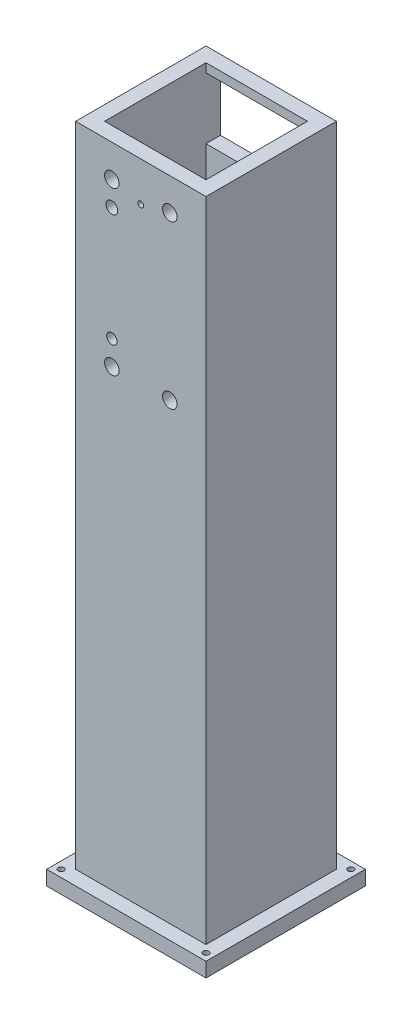
ISO-10303-21;
HEADER;
FILE_DESCRIPTION(('STEP AP214'),'2;1');
FILE_NAME('part.step','',(''),(''),'','','');
FILE_SCHEMA(('AUTOMOTIVE_DESIGN { 1 0 10303 214 1 1 1 1 }'));
ENDSEC;
DATA;
#1=APPLICATION_CONTEXT('core data for automotive mechanical design processes');
#2=APPLICATION_PROTOCOL_DEFINITION('international standard','automotive_design',2000,#1);
#3=PRODUCT_CONTEXT('',#1,'mechanical');
#4=PRODUCT('Part','Part','',(#3));
#5=PRODUCT_RELATED_PRODUCT_CATEGORY('part','',(#4));
#6=PRODUCT_DEFINITION_FORMATION('','',#4);
#7=PRODUCT_DEFINITION_CONTEXT('part definition',#1,'design');
#8=PRODUCT_DEFINITION('design','',#6,#7);
#9=PRODUCT_DEFINITION_SHAPE('','',#8);
#10=(LENGTH_UNIT() NAMED_UNIT(*) SI_UNIT(.MILLI.,.METRE.));
#11=(NAMED_UNIT(*) PLANE_ANGLE_UNIT() SI_UNIT($,.RADIAN.));
#12=(NAMED_UNIT(*) SI_UNIT($,.STERADIAN.) SOLID_ANGLE_UNIT());
#13=UNCERTAINTY_MEASURE_WITH_UNIT(LENGTH_MEASURE(1.E-05),#10,'distance_accuracy_value','');
#14=(GEOMETRIC_REPRESENTATION_CONTEXT(3) GLOBAL_UNCERTAINTY_ASSIGNED_CONTEXT((#13)) GLOBAL_UNIT_ASSIGNED_CONTEXT((#10,
#11,#12)) REPRESENTATION_CONTEXT('',''));
#15=CARTESIAN_POINT('',(0.,0.,0.));
#16=DIRECTION('',(0.,0.,1.));
#17=DIRECTION('',(1.,0.,0.));
#18=AXIS2_PLACEMENT_3D('',#15,#16,#17);
#19=CARTESIAN_POINT('',(-17.5,0.,-17.5));
#20=DIRECTION('',(0.,0.,1.));
#21=DIRECTION('',(1.,0.,0.));
#22=AXIS2_PLACEMENT_3D('',#19,#20,#21);
#23=PLANE('',#22);
#24=DIRECTION('',(1.,0.,0.));
#25=VECTOR('',#24,1.);
#26=CARTESIAN_POINT('',(-17.5,273.612120728358,-17.5));
#27=LINE('',#26,#25);
#28=CARTESIAN_POINT('',(-17.5,273.612120728358,-17.5));
#29=VERTEX_POINT('',#28);
#30=CARTESIAN_POINT('',(17.5,273.612120728358,-17.5));
#31=VERTEX_POINT('',#30);
#32=EDGE_CURVE('E264',#29,#31,#27,.T.);
#33=ORIENTED_EDGE('',*,*,#32,.F.);
#34=DIRECTION('',(0.,1.,0.));
#35=VECTOR('',#34,1.);
#36=CARTESIAN_POINT('',(-17.5,0.,-17.5));
#37=LINE('',#36,#35);
#38=CARTESIAN_POINT('',(-17.5,270.587205010945,-17.5));
#39=VERTEX_POINT('',#38);
#40=EDGE_CURVE('E309',#39,#29,#37,.T.);
#41=ORIENTED_EDGE('',*,*,#40,.F.);
#42=DIRECTION('',(1.,0.,0.));
#43=VECTOR('',#42,1.);
#44=CARTESIAN_POINT('',(-17.5,270.587205010945,-17.5));
#45=LINE('',#44,#43);
#46=CARTESIAN_POINT('',(17.5,270.587205010945,-17.5));
#47=VERTEX_POINT('',#46);
#48=EDGE_CURVE('E328',#39,#47,#45,.T.);
#49=ORIENTED_EDGE('',*,*,#48,.T.);
#50=DIRECTION('',(0.,1.,0.));
#51=VECTOR('',#50,1.);
#52=CARTESIAN_POINT('',(17.5,0.,-17.5));
#53=LINE('',#52,#51);
#54=EDGE_CURVE('E305',#47,#31,#53,.T.);
#55=ORIENTED_EDGE('',*,*,#54,.T.);
#56=EDGE_LOOP('',(#33,#41,#49,#55));
#57=FACE_BOUND('',#56,.T.);
#58=ADVANCED_FACE('F47',(#57),#23,.T.);
#59=CARTESIAN_POINT('',(22.5,300.,22.5));
#60=DIRECTION('',(-1.,0.,0.));
#61=DIRECTION('',(0.,0.,1.));
#62=AXIS2_PLACEMENT_3D('',#59,#60,#61);
#63=PLANE('',#62);
#64=DIRECTION('',(0.,-1.,0.));
#65=VECTOR('',#64,1.);
#66=CARTESIAN_POINT('',(22.5,300.,22.5));
#67=LINE('',#66,#65);
#68=CARTESIAN_POINT('',(22.5,273.612120728358,22.5));
#69=VERTEX_POINT('',#68);
#70=CARTESIAN_POINT('',(22.5,50.,22.5));
#71=VERTEX_POINT('',#70);
#72=EDGE_CURVE('E313',#69,#71,#67,.T.);
#73=ORIENTED_EDGE('',*,*,#72,.T.);
#74=DIRECTION('',(0.,0.,1.));
#75=VECTOR('',#74,1.);
#76=CARTESIAN_POINT('',(22.5,50.,22.5));
#77=LINE('',#76,#75);
#78=CARTESIAN_POINT('',(22.5,50.,-22.5));
#79=VERTEX_POINT('',#78);
#80=EDGE_CURVE('E214',#79,#71,#77,.T.);
#81=ORIENTED_EDGE('',*,*,#80,.F.);
#82=DIRECTION('',(0.,-1.,0.));
#83=VECTOR('',#82,1.);
#84=CARTESIAN_POINT('',(22.5,300.,-22.5));
#85=LINE('',#84,#83);
#86=CARTESIAN_POINT('',(22.5,273.612120728358,-22.5));
#87=VERTEX_POINT('',#86);
#88=EDGE_CURVE('E324',#87,#79,#85,.T.);
#89=ORIENTED_EDGE('',*,*,#88,.F.);
#90=DIRECTION('',(0.,0.,1.));
#91=VECTOR('',#90,1.);
#92=CARTESIAN_POINT('',(22.5,273.612120728358,-22.5));
#93=LINE('',#92,#91);
#94=EDGE_CURVE('E252',#87,#69,#93,.T.);
#95=ORIENTED_EDGE('',*,*,#94,.T.);
#96=EDGE_LOOP('',(#73,#81,#89,#95));
#97=FACE_BOUND('',#96,.T.);
#98=ADVANCED_FACE('F49',(#97),#63,.F.);
#99=CARTESIAN_POINT('',(-22.5,300.,-22.5));
#100=DIRECTION('',(0.,0.,1.));
#101=DIRECTION('',(1.,0.,0.));
#102=AXIS2_PLACEMENT_3D('',#99,#100,#101);
#103=PLANE('',#102);
#104=CARTESIAN_POINT('',(-10.,206.502607410294,-22.5));
#105=DIRECTION('',(0.,0.,1.));
#106=DIRECTION('',(1.,0.,0.));
#107=AXIS2_PLACEMENT_3D('',#104,#105,#106);
#108=CIRCLE('',#107,2.5);
#109=CARTESIAN_POINT('',(-7.5,206.502607410294,-22.5));
#110=VERTEX_POINT('',#109);
#111=EDGE_CURVE('E363',#110,#110,#108,.T.);
#112=ORIENTED_EDGE('',*,*,#111,.T.);
#113=EDGE_LOOP('',(#112));
#114=FACE_BOUND('',#113,.T.);
#115=CARTESIAN_POINT('',(-10.,214.902607410294,-22.5));
#116=DIRECTION('',(0.,0.,1.));
#117=DIRECTION('',(1.,0.,0.));
#118=AXIS2_PLACEMENT_3D('',#115,#116,#117);
#119=CIRCLE('',#118,1.79330821876043);
#120=CARTESIAN_POINT('',(-8.20669178123957,214.902607410294,-22.5));
#121=VERTEX_POINT('',#120);
#122=EDGE_CURVE('E358',#121,#121,#119,.T.);
#123=ORIENTED_EDGE('',*,*,#122,.T.);
#124=EDGE_LOOP('',(#123));
#125=FACE_BOUND('',#124,.T.);
#126=CARTESIAN_POINT('',(10.,206.502607410294,-22.5));
#127=DIRECTION('',(0.,0.,1.));
#128=DIRECTION('',(1.,0.,0.));
#129=AXIS2_PLACEMENT_3D('',#126,#127,#128);
#130=CIRCLE('',#129,2.5);
#131=CARTESIAN_POINT('',(12.5,206.502607410294,-22.5));
#132=VERTEX_POINT('',#131);
#133=EDGE_CURVE('E352',#132,#132,#130,.T.);
#134=ORIENTED_EDGE('',*,*,#133,.T.);
#135=EDGE_LOOP('',(#134));
#136=FACE_BOUND('',#135,.T.);
#137=DIRECTION('',(0.,1.,0.));
#138=VECTOR('',#137,1.);
#139=CARTESIAN_POINT('',(-17.5,249.412794989055,-22.5));
#140=LINE('',#139,#138);
#141=CARTESIAN_POINT('',(-17.5,249.412794989055,-22.5));
#142=VERTEX_POINT('',#141);
#143=CARTESIAN_POINT('',(-17.5,270.587205010945,-22.5));
#144=VERTEX_POINT('',#143);
#145=EDGE_CURVE('E275',#142,#144,#140,.T.);
#146=ORIENTED_EDGE('',*,*,#145,.F.);
#147=DIRECTION('',(-1.,0.,0.));
#148=VECTOR('',#147,1.);
#149=CARTESIAN_POINT('',(17.5,249.412794989055,-22.5));
#150=LINE('',#149,#148);
#151=CARTESIAN_POINT('',(17.5,249.412794989055,-22.5));
#152=VERTEX_POINT('',#151);
#153=EDGE_CURVE('E272',#152,#142,#150,.T.);
#154=ORIENTED_EDGE('',*,*,#153,.F.);
#155=DIRECTION('',(0.,1.,0.));
#156=VECTOR('',#155,1.);
#157=CARTESIAN_POINT('',(17.5,249.412794989055,-22.5));
#158=LINE('',#157,#156);
#159=CARTESIAN_POINT('',(17.5,270.587205010945,-22.5));
#160=VERTEX_POINT('',#159);
#161=EDGE_CURVE('E283',#152,#160,#158,.T.);
#162=ORIENTED_EDGE('',*,*,#161,.T.);
#163=DIRECTION('',(-1.,0.,0.));
#164=VECTOR('',#163,1.);
#165=CARTESIAN_POINT('',(17.5,270.587205010945,-22.5));
#166=LINE('',#165,#164);
#167=EDGE_CURVE('E279',#160,#144,#166,.T.);
#168=ORIENTED_EDGE('',*,*,#167,.T.);
#169=EDGE_LOOP('',(#146,#154,#162,#168));
#170=FACE_BOUND('',#169,.T.);
#171=ORIENTED_EDGE('',*,*,#88,.T.);
#172=DIRECTION('',(1.,0.,0.));
#173=VECTOR('',#172,1.);
#174=CARTESIAN_POINT('',(-22.5,50.,-22.5));
#175=LINE('',#174,#173);
#176=CARTESIAN_POINT('',(-22.5,50.,-22.5));
#177=VERTEX_POINT('',#176);
#178=EDGE_CURVE('E227',#177,#79,#175,.T.);
#179=ORIENTED_EDGE('',*,*,#178,.F.);
#180=DIRECTION('',(0.,-1.,0.));
#181=VECTOR('',#180,1.);
#182=CARTESIAN_POINT('',(-22.5,300.,-22.5));
#183=LINE('',#182,#181);
#184=CARTESIAN_POINT('',(-22.5,273.612120728358,-22.5));
#185=VERTEX_POINT('',#184);
#186=EDGE_CURVE('E320',#185,#177,#183,.T.);
#187=ORIENTED_EDGE('',*,*,#186,.F.);
#188=DIRECTION('',(1.,0.,0.));
#189=VECTOR('',#188,1.);
#190=CARTESIAN_POINT('',(-22.5,273.612120728358,-22.5));
#191=LINE('',#190,#189);
#192=EDGE_CURVE('E246',#185,#87,#191,.T.);
#193=ORIENTED_EDGE('',*,*,#192,.T.);
#194=EDGE_LOOP('',(#171,#179,#187,#193));
#195=FACE_BOUND('',#194,.T.);
#196=ADVANCED_FACE('F442',(#114,#125,#136,#170,#195),#103,.F.);
#197=CARTESIAN_POINT('',(-22.5,300.,22.5));
#198=DIRECTION('',(1.,0.,0.));
#199=DIRECTION('',(0.,0.,-1.));
#200=AXIS2_PLACEMENT_3D('',#197,#198,#199);
#201=PLANE('',#200);
#202=ORIENTED_EDGE('',*,*,#186,.T.);
#203=DIRECTION('',(0.,0.,1.));
#204=VECTOR('',#203,1.);
#205=CARTESIAN_POINT('',(-22.5,50.,22.5));
#206=LINE('',#205,#204);
#207=CARTESIAN_POINT('',(-22.5,50.,22.5));
#208=VERTEX_POINT('',#207);
#209=EDGE_CURVE('E224',#177,#208,#206,.T.);
#210=ORIENTED_EDGE('',*,*,#209,.T.);
#211=DIRECTION('',(0.,-1.,0.));
#212=VECTOR('',#211,1.);
#213=CARTESIAN_POINT('',(-22.5,300.,22.5));
#214=LINE('',#213,#212);
#215=CARTESIAN_POINT('',(-22.5,273.612120728358,22.5));
#216=VERTEX_POINT('',#215);
#217=EDGE_CURVE('E316',#216,#208,#214,.T.);
#218=ORIENTED_EDGE('',*,*,#217,.F.);
#219=DIRECTION('',(0.,0.,1.));
#220=VECTOR('',#219,1.);
#221=CARTESIAN_POINT('',(-22.5,273.612120728358,-22.5));
#222=LINE('',#221,#220);
#223=EDGE_CURVE('E65',#185,#216,#222,.T.);
#224=ORIENTED_EDGE('',*,*,#223,.F.);
#225=EDGE_LOOP('',(#202,#210,#218,#224));
#226=FACE_BOUND('',#225,.T.);
#227=ADVANCED_FACE('F439',(#226),#201,.F.);
#228=CARTESIAN_POINT('',(-22.5,300.,22.5));
#229=DIRECTION('',(0.,0.,-1.));
#230=DIRECTION('',(-1.,0.,0.));
#231=AXIS2_PLACEMENT_3D('',#228,#229,#230);
#232=PLANE('',#231);
#233=CARTESIAN_POINT('',(10.,262.502607410294,22.5));
#234=DIRECTION('',(0.,0.,-1.));
#235=DIRECTION('',(-1.,0.,0.));
#236=AXIS2_PLACEMENT_3D('',#233,#234,#235);
#237=CIRCLE('',#236,2.5);
#238=CARTESIAN_POINT('',(7.5,262.502607410294,22.5));
#239=VERTEX_POINT('',#238);
#240=EDGE_CURVE('E381',#239,#239,#237,.T.);
#241=ORIENTED_EDGE('',*,*,#240,.T.);
#242=EDGE_LOOP('',(#241));
#243=FACE_BOUND('',#242,.T.);
#244=CARTESIAN_POINT('',(-10.,206.502607410294,22.5));
#245=DIRECTION('',(0.,0.,-1.));
#246=DIRECTION('',(-1.,0.,0.));
#247=AXIS2_PLACEMENT_3D('',#244,#245,#246);
#248=CIRCLE('',#247,2.5);
#249=CARTESIAN_POINT('',(-12.5,206.502607410294,22.5));
#250=VERTEX_POINT('',#249);
#251=EDGE_CURVE('E565',#250,#250,#248,.T.);
#252=ORIENTED_EDGE('',*,*,#251,.T.);
#253=EDGE_LOOP('',(#252));
#254=FACE_BOUND('',#253,.T.);
#255=CARTESIAN_POINT('',(-10.,214.902607410294,22.5));
#256=DIRECTION('',(0.,0.,-1.));
#257=DIRECTION('',(-1.,0.,0.));
#258=AXIS2_PLACEMENT_3D('',#255,#256,#257);
#259=CIRCLE('',#258,1.79330821876043);
#260=CARTESIAN_POINT('',(-11.7933082187604,214.902607410294,22.5));
#261=VERTEX_POINT('',#260);
#262=EDGE_CURVE('E557',#261,#261,#259,.T.);
#263=ORIENTED_EDGE('',*,*,#262,.T.);
#264=EDGE_LOOP('',(#263));
#265=FACE_BOUND('',#264,.T.);
#266=CARTESIAN_POINT('',(-10.,254.102607410294,22.5));
#267=DIRECTION('',(0.,0.,-1.));
#268=DIRECTION('',(-1.,0.,0.));
#269=AXIS2_PLACEMENT_3D('',#266,#267,#268);
#270=CIRCLE('',#269,2.02999999999999);
#271=CARTESIAN_POINT('',(-12.03,254.102607410294,22.5));
#272=VERTEX_POINT('',#271);
#273=EDGE_CURVE('E367',#272,#272,#270,.T.);
#274=ORIENTED_EDGE('',*,*,#273,.T.);
#275=EDGE_LOOP('',(#274));
#276=FACE_BOUND('',#275,.T.);
#277=CARTESIAN_POINT('',(10.,206.502607410294,22.5));
#278=DIRECTION('',(0.,0.,-1.));
#279=DIRECTION('',(-1.,0.,0.));
#280=AXIS2_PLACEMENT_3D('',#277,#278,#279);
#281=CIRCLE('',#280,2.5);
#282=CARTESIAN_POINT('',(7.5,206.502607410294,22.5));
#283=VERTEX_POINT('',#282);
#284=EDGE_CURVE('E547',#283,#283,#281,.T.);
#285=ORIENTED_EDGE('',*,*,#284,.T.);
#286=EDGE_LOOP('',(#285));
#287=FACE_BOUND('',#286,.T.);
#288=CARTESIAN_POINT('',(-10.,262.502607410294,22.5));
#289=DIRECTION('',(0.,0.,-1.));
#290=DIRECTION('',(-1.,0.,0.));
#291=AXIS2_PLACEMENT_3D('',#288,#289,#290);
#292=CIRCLE('',#291,2.5);
#293=CARTESIAN_POINT('',(-12.5,262.502607410294,22.5));
#294=VERTEX_POINT('',#293);
#295=EDGE_CURVE('E362',#294,#294,#292,.T.);
#296=ORIENTED_EDGE('',*,*,#295,.T.);
#297=EDGE_LOOP('',(#296));
#298=FACE_BOUND('',#297,.T.);
#299=CARTESIAN_POINT('',(0.,260.,22.5));
#300=DIRECTION('',(0.,0.,1.));
#301=DIRECTION('',(1.,0.,0.));
#302=AXIS2_PLACEMENT_3D('',#299,#300,#301);
#303=CIRCLE('',#302,1.);
#304=CARTESIAN_POINT('',(1.,260.,22.5));
#305=VERTEX_POINT('',#304);
#306=EDGE_CURVE('E267',#305,#305,#303,.T.);
#307=ORIENTED_EDGE('',*,*,#306,.F.);
#308=EDGE_LOOP('',(#307));
#309=FACE_BOUND('',#308,.T.);
#310=ORIENTED_EDGE('',*,*,#217,.T.);
#311=DIRECTION('',(1.,0.,0.));
#312=VECTOR('',#311,1.);
#313=CARTESIAN_POINT('',(-22.5,50.,22.5));
#314=LINE('',#313,#312);
#315=EDGE_CURVE('E228',#208,#71,#314,.T.);
#316=ORIENTED_EDGE('',*,*,#315,.T.);
#317=ORIENTED_EDGE('',*,*,#72,.F.);
#318=DIRECTION('',(1.,0.,0.));
#319=VECTOR('',#318,1.);
#320=CARTESIAN_POINT('',(-22.5,273.612120728358,22.5));
#321=LINE('',#320,#319);
#322=EDGE_CURVE('E245',#216,#69,#321,.T.);
#323=ORIENTED_EDGE('',*,*,#322,.F.);
#324=EDGE_LOOP('',(#310,#316,#317,#323));
#325=FACE_BOUND('',#324,.T.);
#326=ADVANCED_FACE('F436',(#243,#254,#265,#276,#287,#298,#309,#325),#232,.F.);
#327=CARTESIAN_POINT('',(-17.5,0.,17.5));
#328=DIRECTION('',(1.,0.,0.));
#329=DIRECTION('',(0.,0.,-1.));
#330=AXIS2_PLACEMENT_3D('',#327,#328,#329);
#331=PLANE('',#330);
#332=DIRECTION('',(0.,0.,1.));
#333=VECTOR('',#332,1.);
#334=CARTESIAN_POINT('',(-17.5,50.,17.5));
#335=LINE('',#334,#333);
#336=CARTESIAN_POINT('',(-17.5,50.,-17.5));
#337=VERTEX_POINT('',#336);
#338=CARTESIAN_POINT('',(-17.5,50.,17.5));
#339=VERTEX_POINT('',#338);
#340=EDGE_CURVE('E238',#337,#339,#335,.T.);
#341=ORIENTED_EDGE('',*,*,#340,.F.);
#342=CARTESIAN_POINT('',(-17.5,249.412794989055,-17.5));
#343=VERTEX_POINT('',#342);
#344=EDGE_CURVE('E310',#337,#343,#37,.T.);
#345=ORIENTED_EDGE('',*,*,#344,.T.);
#346=DIRECTION('',(0.,0.,-1.));
#347=VECTOR('',#346,1.);
#348=CARTESIAN_POINT('',(-17.5,249.412794989055,-12.5));
#349=LINE('',#348,#347);
#350=EDGE_CURVE('E287',#343,#142,#349,.T.);
#351=ORIENTED_EDGE('',*,*,#350,.T.);
#352=ORIENTED_EDGE('',*,*,#145,.T.);
#353=DIRECTION('',(0.,0.,-1.));
#354=VECTOR('',#353,1.);
#355=CARTESIAN_POINT('',(-17.5,270.587205010945,-12.5));
#356=LINE('',#355,#354);
#357=EDGE_CURVE('E295',#39,#144,#356,.T.);
#358=ORIENTED_EDGE('',*,*,#357,.F.);
#359=ORIENTED_EDGE('',*,*,#40,.T.);
#360=DIRECTION('',(0.,0.,-1.));
#361=VECTOR('',#360,1.);
#362=CARTESIAN_POINT('',(-17.5,273.612120728358,17.5));
#363=LINE('',#362,#361);
#364=CARTESIAN_POINT('',(-17.5,273.612120728358,17.5));
#365=VERTEX_POINT('',#364);
#366=EDGE_CURVE('E261',#365,#29,#363,.T.);
#367=ORIENTED_EDGE('',*,*,#366,.F.);
#368=DIRECTION('',(0.,1.,0.));
#369=VECTOR('',#368,1.);
#370=CARTESIAN_POINT('',(-17.5,0.,17.5));
#371=LINE('',#370,#369);
#372=EDGE_CURVE('E291',#339,#365,#371,.T.);
#373=ORIENTED_EDGE('',*,*,#372,.F.);
#374=EDGE_LOOP('',(#341,#345,#351,#352,#358,#359,#367,#373));
#375=FACE_BOUND('',#374,.T.);
#376=ADVANCED_FACE('F501',(#375),#331,.T.);
#377=CARTESIAN_POINT('',(17.5,0.,17.5));
#378=DIRECTION('',(1.,0.,0.));
#379=DIRECTION('',(0.,0.,-1.));
#380=AXIS2_PLACEMENT_3D('',#377,#378,#379);
#381=PLANE('',#380);
#382=CARTESIAN_POINT('',(17.5,50.,-17.5));
#383=VERTEX_POINT('',#382);
#384=CARTESIAN_POINT('',(17.5,249.412794989055,-17.5));
#385=VERTEX_POINT('',#384);
#386=EDGE_CURVE('E306',#383,#385,#53,.T.);
#387=ORIENTED_EDGE('',*,*,#386,.F.);
#388=DIRECTION('',(0.,0.,1.));
#389=VECTOR('',#388,1.);
#390=CARTESIAN_POINT('',(17.5,50.,17.5));
#391=LINE('',#390,#389);
#392=CARTESIAN_POINT('',(17.5,50.,17.5));
#393=VERTEX_POINT('',#392);
#394=EDGE_CURVE('E232',#383,#393,#391,.T.);
#395=ORIENTED_EDGE('',*,*,#394,.T.);
#396=DIRECTION('',(0.,1.,0.));
#397=VECTOR('',#396,1.);
#398=CARTESIAN_POINT('',(17.5,0.,17.5));
#399=LINE('',#398,#397);
#400=CARTESIAN_POINT('',(17.5,273.612120728358,17.5));
#401=VERTEX_POINT('',#400);
#402=EDGE_CURVE('E73',#393,#401,#399,.T.);
#403=ORIENTED_EDGE('',*,*,#402,.T.);
#404=DIRECTION('',(0.,0.,-1.));
#405=VECTOR('',#404,1.);
#406=CARTESIAN_POINT('',(17.5,273.612120728358,17.5));
#407=LINE('',#406,#405);
#408=EDGE_CURVE('E256',#401,#31,#407,.T.);
#409=ORIENTED_EDGE('',*,*,#408,.T.);
#410=ORIENTED_EDGE('',*,*,#54,.F.);
#411=DIRECTION('',(0.,0.,-1.));
#412=VECTOR('',#411,1.);
#413=CARTESIAN_POINT('',(17.5,270.587205010945,-12.5));
#414=LINE('',#413,#412);
#415=EDGE_CURVE('E292',#47,#160,#414,.T.);
#416=ORIENTED_EDGE('',*,*,#415,.T.);
#417=ORIENTED_EDGE('',*,*,#161,.F.);
#418=DIRECTION('',(0.,0.,-1.));
#419=VECTOR('',#418,1.);
#420=CARTESIAN_POINT('',(17.5,249.412794989055,-12.5));
#421=LINE('',#420,#419);
#422=EDGE_CURVE('E288',#385,#152,#421,.T.);
#423=ORIENTED_EDGE('',*,*,#422,.F.);
#424=EDGE_LOOP('',(#387,#395,#403,#409,#410,#416,#417,#423));
#425=FACE_BOUND('',#424,.T.);
#426=ADVANCED_FACE('F481',(#425),#381,.F.);
#427=CARTESIAN_POINT('',(-17.5,0.,17.5));
#428=DIRECTION('',(0.,0.,1.));
#429=DIRECTION('',(1.,0.,0.));
#430=AXIS2_PLACEMENT_3D('',#427,#428,#429);
#431=PLANE('',#430);
#432=CARTESIAN_POINT('',(10.,262.502607410294,17.5));
#433=DIRECTION('',(0.,0.,1.));
#434=DIRECTION('',(1.,0.,0.));
#435=AXIS2_PLACEMENT_3D('',#432,#433,#434);
#436=CIRCLE('',#435,2.5);
#437=CARTESIAN_POINT('',(12.5,262.502607410294,17.5));
#438=VERTEX_POINT('',#437);
#439=EDGE_CURVE('E51',#438,#438,#436,.T.);
#440=ORIENTED_EDGE('',*,*,#439,.T.);
#441=EDGE_LOOP('',(#440));
#442=FACE_BOUND('',#441,.T.);
#443=CARTESIAN_POINT('',(-10.,206.502607410294,17.5));
#444=DIRECTION('',(0.,0.,1.));
#445=DIRECTION('',(1.,0.,0.));
#446=AXIS2_PLACEMENT_3D('',#443,#444,#445);
#447=CIRCLE('',#446,2.5);
#448=CARTESIAN_POINT('',(-7.5,206.502607410294,17.5));
#449=VERTEX_POINT('',#448);
#450=EDGE_CURVE('E357',#449,#449,#447,.T.);
#451=ORIENTED_EDGE('',*,*,#450,.T.);
#452=EDGE_LOOP('',(#451));
#453=FACE_BOUND('',#452,.T.);
#454=CARTESIAN_POINT('',(-10.,214.902607410294,17.5));
#455=DIRECTION('',(0.,0.,1.));
#456=DIRECTION('',(1.,0.,0.));
#457=AXIS2_PLACEMENT_3D('',#454,#455,#456);
#458=CIRCLE('',#457,1.79330821876043);
#459=CARTESIAN_POINT('',(-8.20669178123957,214.902607410294,17.5));
#460=VERTEX_POINT('',#459);
#461=EDGE_CURVE('E351',#460,#460,#458,.T.);
#462=ORIENTED_EDGE('',*,*,#461,.T.);
#463=EDGE_LOOP('',(#462));
#464=FACE_BOUND('',#463,.T.);
#465=CARTESIAN_POINT('',(-10.,254.102607410294,17.5));
#466=DIRECTION('',(0.,0.,1.));
#467=DIRECTION('',(1.,0.,0.));
#468=AXIS2_PLACEMENT_3D('',#465,#466,#467);
#469=CIRCLE('',#468,2.02999999999999);
#470=CARTESIAN_POINT('',(-7.97000000000001,254.102607410294,17.5));
#471=VERTEX_POINT('',#470);
#472=EDGE_CURVE('E364',#471,#471,#469,.T.);
#473=ORIENTED_EDGE('',*,*,#472,.T.);
#474=EDGE_LOOP('',(#473));
#475=FACE_BOUND('',#474,.T.);
#476=CARTESIAN_POINT('',(10.,206.502607410294,17.5));
#477=DIRECTION('',(0.,0.,1.));
#478=DIRECTION('',(1.,0.,0.));
#479=AXIS2_PLACEMENT_3D('',#476,#477,#478);
#480=CIRCLE('',#479,2.5);
#481=CARTESIAN_POINT('',(12.5,206.502607410294,17.5));
#482=VERTEX_POINT('',#481);
#483=EDGE_CURVE('E346',#482,#482,#480,.T.);
#484=ORIENTED_EDGE('',*,*,#483,.T.);
#485=EDGE_LOOP('',(#484));
#486=FACE_BOUND('',#485,.T.);
#487=CARTESIAN_POINT('',(-10.,262.502607410294,17.5));
#488=DIRECTION('',(0.,0.,1.));
#489=DIRECTION('',(1.,0.,0.));
#490=AXIS2_PLACEMENT_3D('',#487,#488,#489);
#491=CIRCLE('',#490,2.5);
#492=CARTESIAN_POINT('',(-7.5,262.502607410294,17.5));
#493=VERTEX_POINT('',#492);
#494=EDGE_CURVE('E359',#493,#493,#491,.T.);
#495=ORIENTED_EDGE('',*,*,#494,.T.);
#496=EDGE_LOOP('',(#495));
#497=FACE_BOUND('',#496,.T.);
#498=CARTESIAN_POINT('',(0.,260.,17.5));
#499=DIRECTION('',(0.,0.,1.));
#500=DIRECTION('',(1.,0.,0.));
#501=AXIS2_PLACEMENT_3D('',#498,#499,#500);
#502=CIRCLE('',#501,1.);
#503=CARTESIAN_POINT('',(1.,260.,17.5));
#504=VERTEX_POINT('',#503);
#505=EDGE_CURVE('E271',#504,#504,#502,.T.);
#506=ORIENTED_EDGE('',*,*,#505,.T.);
#507=EDGE_LOOP('',(#506));
#508=FACE_BOUND('',#507,.T.);
#509=ORIENTED_EDGE('',*,*,#402,.F.);
#510=DIRECTION('',(-1.,0.,0.));
#511=VECTOR('',#510,1.);
#512=CARTESIAN_POINT('',(-17.5,50.,17.5));
#513=LINE('',#512,#511);
#514=EDGE_CURVE('E241',#393,#339,#513,.T.);
#515=ORIENTED_EDGE('',*,*,#514,.T.);
#516=ORIENTED_EDGE('',*,*,#372,.T.);
#517=DIRECTION('',(1.,0.,0.));
#518=VECTOR('',#517,1.);
#519=CARTESIAN_POINT('',(-17.5,273.612120728358,17.5));
#520=LINE('',#519,#518);
#521=EDGE_CURVE('E57',#365,#401,#520,.T.);
#522=ORIENTED_EDGE('',*,*,#521,.T.);
#523=EDGE_LOOP('',(#509,#515,#516,#522));
#524=FACE_BOUND('',#523,.T.);
#525=ADVANCED_FACE('F472',(#442,#453,#464,#475,#486,#497,#508,#524),#431,.F.);
#526=CARTESIAN_POINT('',(-10.,206.502607410294,-17.5));
#527=DIRECTION('',(0.,0.,1.));
#528=DIRECTION('',(1.,0.,0.));
#529=AXIS2_PLACEMENT_3D('',#526,#527,#528);
#530=CIRCLE('',#529,2.5);
#531=CARTESIAN_POINT('',(-7.5,206.502607410294,-17.5));
#532=VERTEX_POINT('',#531);
#533=EDGE_CURVE('E353',#532,#532,#530,.T.);
#534=ORIENTED_EDGE('',*,*,#533,.F.);
#535=EDGE_LOOP('',(#534));
#536=FACE_BOUND('',#535,.T.);
#537=CARTESIAN_POINT('',(-10.,214.902607410294,-17.5));
#538=DIRECTION('',(0.,0.,1.));
#539=DIRECTION('',(1.,0.,0.));
#540=AXIS2_PLACEMENT_3D('',#537,#538,#539);
#541=CIRCLE('',#540,1.79330821876043);
#542=CARTESIAN_POINT('',(-8.20669178123957,214.902607410294,-17.5));
#543=VERTEX_POINT('',#542);
#544=EDGE_CURVE('E347',#543,#543,#541,.T.);
#545=ORIENTED_EDGE('',*,*,#544,.F.);
#546=EDGE_LOOP('',(#545));
#547=FACE_BOUND('',#546,.T.);
#548=CARTESIAN_POINT('',(10.,206.502607410294,-17.5));
#549=DIRECTION('',(0.,0.,1.));
#550=DIRECTION('',(1.,0.,0.));
#551=AXIS2_PLACEMENT_3D('',#548,#549,#550);
#552=CIRCLE('',#551,2.5);
#553=CARTESIAN_POINT('',(12.5,206.502607410294,-17.5));
#554=VERTEX_POINT('',#553);
#555=EDGE_CURVE('E342',#554,#554,#552,.T.);
#556=ORIENTED_EDGE('',*,*,#555,.F.);
#557=EDGE_LOOP('',(#556));
#558=FACE_BOUND('',#557,.T.);
#559=DIRECTION('',(-1.,0.,0.));
#560=VECTOR('',#559,1.);
#561=CARTESIAN_POINT('',(-17.5,50.,-17.5));
#562=LINE('',#561,#560);
#563=EDGE_CURVE('E11',#383,#337,#562,.T.);
#564=ORIENTED_EDGE('',*,*,#563,.F.);
#565=ORIENTED_EDGE('',*,*,#386,.T.);
#566=DIRECTION('',(1.,0.,0.));
#567=VECTOR('',#566,1.);
#568=CARTESIAN_POINT('',(-17.5,249.412794989055,-17.5));
#569=LINE('',#568,#567);
#570=EDGE_CURVE('E332',#343,#385,#569,.T.);
#571=ORIENTED_EDGE('',*,*,#570,.F.);
#572=ORIENTED_EDGE('',*,*,#344,.F.);
#573=EDGE_LOOP('',(#564,#565,#571,#572));
#574=FACE_BOUND('',#573,.T.);
#575=ADVANCED_FACE('F462',(#536,#547,#558,#574),#23,.T.);
#576=CARTESIAN_POINT('',(17.5,249.412794989055,-12.5));
#577=DIRECTION('',(0.,-1.,0.));
#578=DIRECTION('',(0.,0.,-1.));
#579=AXIS2_PLACEMENT_3D('',#576,#577,#578);
#580=PLANE('',#579);
#581=ORIENTED_EDGE('',*,*,#570,.T.);
#582=ORIENTED_EDGE('',*,*,#422,.T.);
#583=ORIENTED_EDGE('',*,*,#153,.T.);
#584=ORIENTED_EDGE('',*,*,#350,.F.);
#585=EDGE_LOOP('',(#581,#582,#583,#584));
#586=FACE_BOUND('',#585,.T.);
#587=ADVANCED_FACE('F471',(#586),#580,.F.);
#588=CARTESIAN_POINT('',(17.5,270.587205010945,-12.5));
#589=DIRECTION('',(0.,-1.,0.));
#590=DIRECTION('',(0.,0.,-1.));
#591=AXIS2_PLACEMENT_3D('',#588,#589,#590);
#592=PLANE('',#591);
#593=ORIENTED_EDGE('',*,*,#357,.T.);
#594=ORIENTED_EDGE('',*,*,#167,.F.);
#595=ORIENTED_EDGE('',*,*,#415,.F.);
#596=ORIENTED_EDGE('',*,*,#48,.F.);
#597=EDGE_LOOP('',(#593,#594,#595,#596));
#598=FACE_BOUND('',#597,.T.);
#599=ADVANCED_FACE('F455',(#598),#592,.T.);
#600=CARTESIAN_POINT('',(0.,260.,12.5));
#601=DIRECTION('',(0.,0.,1.));
#602=DIRECTION('',(1.,0.,0.));
#603=AXIS2_PLACEMENT_3D('',#600,#601,#602);
#604=CYLINDRICAL_SURFACE('',#603,1.);
#605=ORIENTED_EDGE('',*,*,#306,.T.);
#606=EDGE_LOOP('',(#605));
#607=FACE_BOUND('',#606,.T.);
#608=ORIENTED_EDGE('',*,*,#505,.F.);
#609=EDGE_LOOP('',(#608));
#610=FACE_BOUND('',#609,.T.);
#611=ADVANCED_FACE('F447',(#607,#610),#604,.F.);
#612=CARTESIAN_POINT('',(-22.5,273.612120728358,-22.5));
#613=DIRECTION('',(0.,-1.,0.));
#614=DIRECTION('',(0.,0.,-1.));
#615=AXIS2_PLACEMENT_3D('',#612,#613,#614);
#616=PLANE('',#615);
#617=ORIENTED_EDGE('',*,*,#32,.T.);
#618=ORIENTED_EDGE('',*,*,#408,.F.);
#619=ORIENTED_EDGE('',*,*,#521,.F.);
#620=ORIENTED_EDGE('',*,*,#366,.T.);
#621=EDGE_LOOP('',(#617,#618,#619,#620));
#622=FACE_BOUND('',#621,.T.);
#623=ORIENTED_EDGE('',*,*,#322,.T.);
#624=ORIENTED_EDGE('',*,*,#94,.F.);
#625=ORIENTED_EDGE('',*,*,#192,.F.);
#626=ORIENTED_EDGE('',*,*,#223,.T.);
#627=EDGE_LOOP('',(#623,#624,#625,#626));
#628=FACE_BOUND('',#627,.T.);
#629=ADVANCED_FACE('F445',(#622,#628),#616,.F.);
#630=CARTESIAN_POINT('',(0.,50.,0.));
#631=DIRECTION('',(0.,1.,0.));
#632=DIRECTION('',(0.,0.,1.));
#633=AXIS2_PLACEMENT_3D('',#630,#631,#632);
#634=PLANE('',#633);
#635=ORIENTED_EDGE('',*,*,#394,.F.);
#636=ORIENTED_EDGE('',*,*,#563,.T.);
#637=ORIENTED_EDGE('',*,*,#340,.T.);
#638=ORIENTED_EDGE('',*,*,#514,.F.);
#639=EDGE_LOOP('',(#635,#636,#637,#638));
#640=FACE_BOUND('',#639,.T.);
#641=ADVANCED_FACE('F423',(#640),#634,.T.);
#642=CARTESIAN_POINT('',(25.,50.,-25.));
#643=DIRECTION('',(0.,1.,0.));
#644=DIRECTION('',(0.,0.,1.));
#645=AXIS2_PLACEMENT_3D('',#642,#643,#644);
#646=CIRCLE('',#645,1.);
#647=CARTESIAN_POINT('',(25.,50.,-24.));
#648=VERTEX_POINT('',#647);
#649=EDGE_CURVE('E197',#648,#648,#646,.T.);
#650=ORIENTED_EDGE('',*,*,#649,.F.);
#651=EDGE_LOOP('',(#650));
#652=FACE_BOUND('',#651,.T.);
#653=CARTESIAN_POINT('',(-25.,50.,-25.));
#654=DIRECTION('',(0.,1.,0.));
#655=DIRECTION('',(0.,0.,1.));
#656=AXIS2_PLACEMENT_3D('',#653,#654,#655);
#657=CIRCLE('',#656,1.);
#658=CARTESIAN_POINT('',(-25.,50.,-24.));
#659=VERTEX_POINT('',#658);
#660=EDGE_CURVE('E408',#659,#659,#657,.T.);
#661=ORIENTED_EDGE('',*,*,#660,.F.);
#662=EDGE_LOOP('',(#661));
#663=FACE_BOUND('',#662,.T.);
#664=CARTESIAN_POINT('',(-25.,50.,25.));
#665=DIRECTION('',(0.,1.,0.));
#666=DIRECTION('',(0.,0.,1.));
#667=AXIS2_PLACEMENT_3D('',#664,#665,#666);
#668=CIRCLE('',#667,1.);
#669=CARTESIAN_POINT('',(-25.,50.,26.));
#670=VERTEX_POINT('',#669);
#671=EDGE_CURVE('E405',#670,#670,#668,.T.);
#672=ORIENTED_EDGE('',*,*,#671,.F.);
#673=EDGE_LOOP('',(#672));
#674=FACE_BOUND('',#673,.T.);
#675=CARTESIAN_POINT('',(25.,50.,25.));
#676=DIRECTION('',(0.,1.,0.));
#677=DIRECTION('',(0.,0.,1.));
#678=AXIS2_PLACEMENT_3D('',#675,#676,#677);
#679=CIRCLE('',#678,1.);
#680=CARTESIAN_POINT('',(25.,50.,26.));
#681=VERTEX_POINT('',#680);
#682=EDGE_CURVE('E401',#681,#681,#679,.T.);
#683=ORIENTED_EDGE('',*,*,#682,.F.);
#684=EDGE_LOOP('',(#683));
#685=FACE_BOUND('',#684,.T.);
#686=DIRECTION('',(0.,0.,1.));
#687=VECTOR('',#686,1.);
#688=CARTESIAN_POINT('',(-27.5,50.,-27.5));
#689=LINE('',#688,#687);
#690=CARTESIAN_POINT('',(-27.5,50.,-27.5));
#691=VERTEX_POINT('',#690);
#692=CARTESIAN_POINT('',(-27.5,50.,27.5));
#693=VERTEX_POINT('',#692);
#694=EDGE_CURVE('E204',#691,#693,#689,.T.);
#695=ORIENTED_EDGE('',*,*,#694,.T.);
#696=DIRECTION('',(1.,0.,0.));
#697=VECTOR('',#696,1.);
#698=CARTESIAN_POINT('',(-27.5,50.,27.5));
#699=LINE('',#698,#697);
#700=CARTESIAN_POINT('',(27.5,50.,27.5));
#701=VERTEX_POINT('',#700);
#702=EDGE_CURVE('E169',#693,#701,#699,.T.);
#703=ORIENTED_EDGE('',*,*,#702,.T.);
#704=DIRECTION('',(0.,0.,1.));
#705=VECTOR('',#704,1.);
#706=CARTESIAN_POINT('',(27.5,50.,-27.5));
#707=LINE('',#706,#705);
#708=CARTESIAN_POINT('',(27.5,50.,-27.5));
#709=VERTEX_POINT('',#708);
#710=EDGE_CURVE('E194',#709,#701,#707,.T.);
#711=ORIENTED_EDGE('',*,*,#710,.F.);
#712=DIRECTION('',(1.,0.,0.));
#713=VECTOR('',#712,1.);
#714=CARTESIAN_POINT('',(-27.5,50.,-27.5));
#715=LINE('',#714,#713);
#716=EDGE_CURVE('E191',#691,#709,#715,.T.);
#717=ORIENTED_EDGE('',*,*,#716,.F.);
#718=EDGE_LOOP('',(#695,#703,#711,#717));
#719=FACE_BOUND('',#718,.T.);
#720=ORIENTED_EDGE('',*,*,#315,.F.);
#721=ORIENTED_EDGE('',*,*,#209,.F.);
#722=ORIENTED_EDGE('',*,*,#178,.T.);
#723=ORIENTED_EDGE('',*,*,#80,.T.);
#724=EDGE_LOOP('',(#720,#721,#722,#723));
#725=FACE_BOUND('',#724,.T.);
#726=ADVANCED_FACE('F420',(#652,#663,#674,#685,#719,#725),#634,.T.);
#727=CARTESIAN_POINT('',(-27.5,45.,-27.5));
#728=DIRECTION('',(-1.,0.,0.));
#729=DIRECTION('',(0.,0.,1.));
#730=AXIS2_PLACEMENT_3D('',#727,#728,#729);
#731=PLANE('',#730);
#732=ORIENTED_EDGE('',*,*,#694,.F.);
#733=DIRECTION('',(0.,1.,0.));
#734=VECTOR('',#733,1.);
#735=CARTESIAN_POINT('',(-27.5,45.,-27.5));
#736=LINE('',#735,#734);
#737=CARTESIAN_POINT('',(-27.5,45.,-27.5));
#738=VERTEX_POINT('',#737);
#739=EDGE_CURVE('E188',#738,#691,#736,.T.);
#740=ORIENTED_EDGE('',*,*,#739,.F.);
#741=DIRECTION('',(0.,0.,1.));
#742=VECTOR('',#741,1.);
#743=CARTESIAN_POINT('',(-27.5,45.,-27.5));
#744=LINE('',#743,#742);
#745=CARTESIAN_POINT('',(-27.5,45.,27.5));
#746=VERTEX_POINT('',#745);
#747=EDGE_CURVE('E181',#738,#746,#744,.T.);
#748=ORIENTED_EDGE('',*,*,#747,.T.);
#749=DIRECTION('',(0.,1.,0.));
#750=VECTOR('',#749,1.);
#751=CARTESIAN_POINT('',(-27.5,45.,27.5));
#752=LINE('',#751,#750);
#753=EDGE_CURVE('E164',#746,#693,#752,.T.);
#754=ORIENTED_EDGE('',*,*,#753,.T.);
#755=EDGE_LOOP('',(#732,#740,#748,#754));
#756=FACE_BOUND('',#755,.T.);
#757=ADVANCED_FACE('F187',(#756),#731,.T.);
#758=CARTESIAN_POINT('',(-27.5,45.,-27.5));
#759=DIRECTION('',(0.,0.,1.));
#760=DIRECTION('',(1.,0.,0.));
#761=AXIS2_PLACEMENT_3D('',#758,#759,#760);
#762=PLANE('',#761);
#763=ORIENTED_EDGE('',*,*,#716,.T.);
#764=DIRECTION('',(0.,1.,0.));
#765=VECTOR('',#764,1.);
#766=CARTESIAN_POINT('',(27.5,45.,-27.5));
#767=LINE('',#766,#765);
#768=CARTESIAN_POINT('',(27.5,45.,-27.5));
#769=VERTEX_POINT('',#768);
#770=EDGE_CURVE('E215',#769,#709,#767,.T.);
#771=ORIENTED_EDGE('',*,*,#770,.F.);
#772=DIRECTION('',(1.,0.,0.));
#773=VECTOR('',#772,1.);
#774=CARTESIAN_POINT('',(-27.5,45.,-27.5));
#775=LINE('',#774,#773);
#776=EDGE_CURVE('E176',#738,#769,#775,.T.);
#777=ORIENTED_EDGE('',*,*,#776,.F.);
#778=ORIENTED_EDGE('',*,*,#739,.T.);
#779=EDGE_LOOP('',(#763,#771,#777,#778));
#780=FACE_BOUND('',#779,.T.);
#781=ADVANCED_FACE('F628',(#780),#762,.F.);
#782=CARTESIAN_POINT('',(27.5,45.,-27.5));
#783=DIRECTION('',(-1.,0.,0.));
#784=DIRECTION('',(0.,0.,1.));
#785=AXIS2_PLACEMENT_3D('',#782,#783,#784);
#786=PLANE('',#785);
#787=ORIENTED_EDGE('',*,*,#710,.T.);
#788=DIRECTION('',(0.,1.,0.));
#789=VECTOR('',#788,1.);
#790=CARTESIAN_POINT('',(27.5,45.,27.5));
#791=LINE('',#790,#789);
#792=CARTESIAN_POINT('',(27.5,45.,27.5));
#793=VERTEX_POINT('',#792);
#794=EDGE_CURVE('E175',#793,#701,#791,.T.);
#795=ORIENTED_EDGE('',*,*,#794,.F.);
#796=DIRECTION('',(0.,0.,1.));
#797=VECTOR('',#796,1.);
#798=CARTESIAN_POINT('',(27.5,45.,-27.5));
#799=LINE('',#798,#797);
#800=EDGE_CURVE('E183',#769,#793,#799,.T.);
#801=ORIENTED_EDGE('',*,*,#800,.F.);
#802=ORIENTED_EDGE('',*,*,#770,.T.);
#803=EDGE_LOOP('',(#787,#795,#801,#802));
#804=FACE_BOUND('',#803,.T.);
#805=ADVANCED_FACE('F631',(#804),#786,.F.);
#806=CARTESIAN_POINT('',(-27.5,45.,27.5));
#807=DIRECTION('',(0.,0.,1.));
#808=DIRECTION('',(1.,0.,0.));
#809=AXIS2_PLACEMENT_3D('',#806,#807,#808);
#810=PLANE('',#809);
#811=ORIENTED_EDGE('',*,*,#702,.F.);
#812=ORIENTED_EDGE('',*,*,#753,.F.);
#813=DIRECTION('',(1.,0.,0.));
#814=VECTOR('',#813,1.);
#815=CARTESIAN_POINT('',(-27.5,45.,27.5));
#816=LINE('',#815,#814);
#817=EDGE_CURVE('E167',#746,#793,#816,.T.);
#818=ORIENTED_EDGE('',*,*,#817,.T.);
#819=ORIENTED_EDGE('',*,*,#794,.T.);
#820=EDGE_LOOP('',(#811,#812,#818,#819));
#821=FACE_BOUND('',#820,.T.);
#822=ADVANCED_FACE('F166',(#821),#810,.T.);
#823=CARTESIAN_POINT('',(0.,45.,0.));
#824=DIRECTION('',(0.,1.,0.));
#825=DIRECTION('',(0.,0.,1.));
#826=AXIS2_PLACEMENT_3D('',#823,#824,#825);
#827=PLANE('',#826);
#828=CARTESIAN_POINT('',(25.,45.,-25.));
#829=DIRECTION('',(0.,-1.,0.));
#830=DIRECTION('',(0.,0.,-1.));
#831=AXIS2_PLACEMENT_3D('',#828,#829,#830);
#832=CIRCLE('',#831,1.);
#833=CARTESIAN_POINT('',(25.,45.,-26.));
#834=VERTEX_POINT('',#833);
#835=EDGE_CURVE('E385',#834,#834,#832,.T.);
#836=ORIENTED_EDGE('',*,*,#835,.F.);
#837=EDGE_LOOP('',(#836));
#838=FACE_BOUND('',#837,.T.);
#839=CARTESIAN_POINT('',(-25.,45.,-25.));
#840=DIRECTION('',(0.,-1.,0.));
#841=DIRECTION('',(0.,0.,-1.));
#842=AXIS2_PLACEMENT_3D('',#839,#840,#841);
#843=CIRCLE('',#842,1.);
#844=CARTESIAN_POINT('',(-25.,45.,-26.));
#845=VERTEX_POINT('',#844);
#846=EDGE_CURVE('E391',#845,#845,#843,.T.);
#847=ORIENTED_EDGE('',*,*,#846,.F.);
#848=EDGE_LOOP('',(#847));
#849=FACE_BOUND('',#848,.T.);
#850=CARTESIAN_POINT('',(-25.,45.,25.));
#851=DIRECTION('',(0.,-1.,0.));
#852=DIRECTION('',(0.,0.,-1.));
#853=AXIS2_PLACEMENT_3D('',#850,#851,#852);
#854=CIRCLE('',#853,1.);
#855=CARTESIAN_POINT('',(-25.,45.,24.));
#856=VERTEX_POINT('',#855);
#857=EDGE_CURVE('E386',#856,#856,#854,.T.);
#858=ORIENTED_EDGE('',*,*,#857,.F.);
#859=EDGE_LOOP('',(#858));
#860=FACE_BOUND('',#859,.T.);
#861=CARTESIAN_POINT('',(25.,45.,25.));
#862=DIRECTION('',(0.,-1.,0.));
#863=DIRECTION('',(0.,0.,-1.));
#864=AXIS2_PLACEMENT_3D('',#861,#862,#863);
#865=CIRCLE('',#864,1.);
#866=CARTESIAN_POINT('',(25.,45.,24.));
#867=VERTEX_POINT('',#866);
#868=EDGE_CURVE('E390',#867,#867,#865,.T.);
#869=ORIENTED_EDGE('',*,*,#868,.F.);
#870=EDGE_LOOP('',(#869));
#871=FACE_BOUND('',#870,.T.);
#872=ORIENTED_EDGE('',*,*,#747,.F.);
#873=ORIENTED_EDGE('',*,*,#776,.T.);
#874=ORIENTED_EDGE('',*,*,#800,.T.);
#875=ORIENTED_EDGE('',*,*,#817,.F.);
#876=EDGE_LOOP('',(#872,#873,#874,#875));
#877=FACE_BOUND('',#876,.T.);
#878=ADVANCED_FACE('F180',(#838,#849,#860,#871,#877),#827,.F.);
#879=CARTESIAN_POINT('',(25.,273.612120728358,25.));
#880=DIRECTION('',(0.,-1.,0.));
#881=DIRECTION('',(0.,0.,-1.));
#882=AXIS2_PLACEMENT_3D('',#879,#880,#881);
#883=CYLINDRICAL_SURFACE('',#882,1.);
#884=ORIENTED_EDGE('',*,*,#682,.T.);
#885=EDGE_LOOP('',(#884));
#886=FACE_BOUND('',#885,.T.);
#887=ORIENTED_EDGE('',*,*,#868,.T.);
#888=EDGE_LOOP('',(#887));
#889=FACE_BOUND('',#888,.T.);
#890=ADVANCED_FACE('F616',(#886,#889),#883,.F.);
#891=CARTESIAN_POINT('',(-25.,273.612120728358,25.));
#892=DIRECTION('',(0.,-1.,0.));
#893=DIRECTION('',(0.,0.,-1.));
#894=AXIS2_PLACEMENT_3D('',#891,#892,#893);
#895=CYLINDRICAL_SURFACE('',#894,1.);
#896=ORIENTED_EDGE('',*,*,#671,.T.);
#897=EDGE_LOOP('',(#896));
#898=FACE_BOUND('',#897,.T.);
#899=ORIENTED_EDGE('',*,*,#857,.T.);
#900=EDGE_LOOP('',(#899));
#901=FACE_BOUND('',#900,.T.);
#902=ADVANCED_FACE('F612',(#898,#901),#895,.F.);
#903=CARTESIAN_POINT('',(-25.,273.612120728358,-25.));
#904=DIRECTION('',(0.,-1.,0.));
#905=DIRECTION('',(0.,0.,-1.));
#906=AXIS2_PLACEMENT_3D('',#903,#904,#905);
#907=CYLINDRICAL_SURFACE('',#906,1.);
#908=ORIENTED_EDGE('',*,*,#660,.T.);
#909=EDGE_LOOP('',(#908));
#910=FACE_BOUND('',#909,.T.);
#911=ORIENTED_EDGE('',*,*,#846,.T.);
#912=EDGE_LOOP('',(#911));
#913=FACE_BOUND('',#912,.T.);
#914=ADVANCED_FACE('F615',(#910,#913),#907,.F.);
#915=CARTESIAN_POINT('',(25.,273.612120728358,-25.));
#916=DIRECTION('',(0.,-1.,0.));
#917=DIRECTION('',(0.,0.,-1.));
#918=AXIS2_PLACEMENT_3D('',#915,#916,#917);
#919=CYLINDRICAL_SURFACE('',#918,1.);
#920=ORIENTED_EDGE('',*,*,#649,.T.);
#921=EDGE_LOOP('',(#920));
#922=FACE_BOUND('',#921,.T.);
#923=ORIENTED_EDGE('',*,*,#835,.T.);
#924=EDGE_LOOP('',(#923));
#925=FACE_BOUND('',#924,.T.);
#926=ADVANCED_FACE('F417',(#922,#925),#919,.F.);
#927=CARTESIAN_POINT('',(10.,206.502607410294,-27.5));
#928=DIRECTION('',(0.,0.,1.));
#929=DIRECTION('',(1.,0.,0.));
#930=AXIS2_PLACEMENT_3D('',#927,#928,#929);
#931=CYLINDRICAL_SURFACE('',#930,2.5);
#932=ORIENTED_EDGE('',*,*,#555,.T.);
#933=EDGE_LOOP('',(#932));
#934=FACE_BOUND('',#933,.T.);
#935=ORIENTED_EDGE('',*,*,#133,.F.);
#936=EDGE_LOOP('',(#935));
#937=FACE_BOUND('',#936,.T.);
#938=ADVANCED_FACE('F602',(#934,#937),#931,.F.);
#939=CARTESIAN_POINT('',(-10.,214.902607410294,-27.5));
#940=DIRECTION('',(0.,0.,1.));
#941=DIRECTION('',(1.,0.,0.));
#942=AXIS2_PLACEMENT_3D('',#939,#940,#941);
#943=CYLINDRICAL_SURFACE('',#942,1.79330821876043);
#944=ORIENTED_EDGE('',*,*,#544,.T.);
#945=EDGE_LOOP('',(#944));
#946=FACE_BOUND('',#945,.T.);
#947=ORIENTED_EDGE('',*,*,#122,.F.);
#948=EDGE_LOOP('',(#947));
#949=FACE_BOUND('',#948,.T.);
#950=ADVANCED_FACE('F589',(#946,#949),#943,.F.);
#951=CARTESIAN_POINT('',(-10.,206.502607410294,-27.5));
#952=DIRECTION('',(0.,0.,1.));
#953=DIRECTION('',(1.,0.,0.));
#954=AXIS2_PLACEMENT_3D('',#951,#952,#953);
#955=CYLINDRICAL_SURFACE('',#954,2.5);
#956=ORIENTED_EDGE('',*,*,#533,.T.);
#957=EDGE_LOOP('',(#956));
#958=FACE_BOUND('',#957,.T.);
#959=ORIENTED_EDGE('',*,*,#111,.F.);
#960=EDGE_LOOP('',(#959));
#961=FACE_BOUND('',#960,.T.);
#962=ADVANCED_FACE('F579',(#958,#961),#955,.F.);
#963=CARTESIAN_POINT('',(-10.,262.502607410294,-27.5));
#964=DIRECTION('',(0.,0.,1.));
#965=DIRECTION('',(1.,0.,0.));
#966=AXIS2_PLACEMENT_3D('',#963,#964,#965);
#967=CYLINDRICAL_SURFACE('',#966,2.5);
#968=ORIENTED_EDGE('',*,*,#494,.F.);
#969=EDGE_LOOP('',(#968));
#970=FACE_BOUND('',#969,.T.);
#971=ORIENTED_EDGE('',*,*,#295,.F.);
#972=EDGE_LOOP('',(#971));
#973=FACE_BOUND('',#972,.T.);
#974=ADVANCED_FACE('F593',(#970,#973),#967,.F.);
#975=ORIENTED_EDGE('',*,*,#483,.F.);
#976=EDGE_LOOP('',(#975));
#977=FACE_BOUND('',#976,.T.);
#978=ORIENTED_EDGE('',*,*,#284,.F.);
#979=EDGE_LOOP('',(#978));
#980=FACE_BOUND('',#979,.T.);
#981=ADVANCED_FACE('F599',(#977,#980),#931,.F.);
#982=CARTESIAN_POINT('',(-10.,254.102607410294,-27.5));
#983=DIRECTION('',(0.,0.,1.));
#984=DIRECTION('',(1.,0.,0.));
#985=AXIS2_PLACEMENT_3D('',#982,#983,#984);
#986=CYLINDRICAL_SURFACE('',#985,2.02999999999999);
#987=ORIENTED_EDGE('',*,*,#472,.F.);
#988=EDGE_LOOP('',(#987));
#989=FACE_BOUND('',#988,.T.);
#990=ORIENTED_EDGE('',*,*,#273,.F.);
#991=EDGE_LOOP('',(#990));
#992=FACE_BOUND('',#991,.T.);
#993=ADVANCED_FACE('F586',(#989,#992),#986,.F.);
#994=ORIENTED_EDGE('',*,*,#461,.F.);
#995=EDGE_LOOP('',(#994));
#996=FACE_BOUND('',#995,.T.);
#997=ORIENTED_EDGE('',*,*,#262,.F.);
#998=EDGE_LOOP('',(#997));
#999=FACE_BOUND('',#998,.T.);
#1000=ADVANCED_FACE('F576',(#996,#999),#943,.F.);
#1001=ORIENTED_EDGE('',*,*,#450,.F.);
#1002=EDGE_LOOP('',(#1001));
#1003=FACE_BOUND('',#1002,.T.);
#1004=ORIENTED_EDGE('',*,*,#251,.F.);
#1005=EDGE_LOOP('',(#1004));
#1006=FACE_BOUND('',#1005,.T.);
#1007=ADVANCED_FACE('F573',(#1003,#1006),#955,.F.);
#1008=CARTESIAN_POINT('',(10.,262.502607410294,-27.5));
#1009=DIRECTION('',(0.,0.,1.));
#1010=DIRECTION('',(1.,0.,0.));
#1011=AXIS2_PLACEMENT_3D('',#1008,#1009,#1010);
#1012=CYLINDRICAL_SURFACE('',#1011,2.5);
#1013=ORIENTED_EDGE('',*,*,#439,.F.);
#1014=EDGE_LOOP('',(#1013));
#1015=FACE_BOUND('',#1014,.T.);
#1016=ORIENTED_EDGE('',*,*,#240,.F.);
#1017=EDGE_LOOP('',(#1016));
#1018=FACE_BOUND('',#1017,.T.);
#1019=ADVANCED_FACE('F575',(#1015,#1018),#1012,.F.);
#1020=CLOSED_SHELL('',(#58,#98,#196,#227,#326,#376,#426,#525,#575,#587,#599,#611,#629,#641,#726,
#757,#781,#805,#822,#878,#890,#902,#914,#926,#938,#950,#962,#974,#981,#993,#1000,#1007,#1019));
#1021=MANIFOLD_SOLID_BREP('B2',#1020);
#1022=ADVANCED_BREP_SHAPE_REPRESENTATION('',(#18,#1021),#14);
#1023=SHAPE_DEFINITION_REPRESENTATION(#9,#1022);
ENDSEC;
END-ISO-10303-21;
